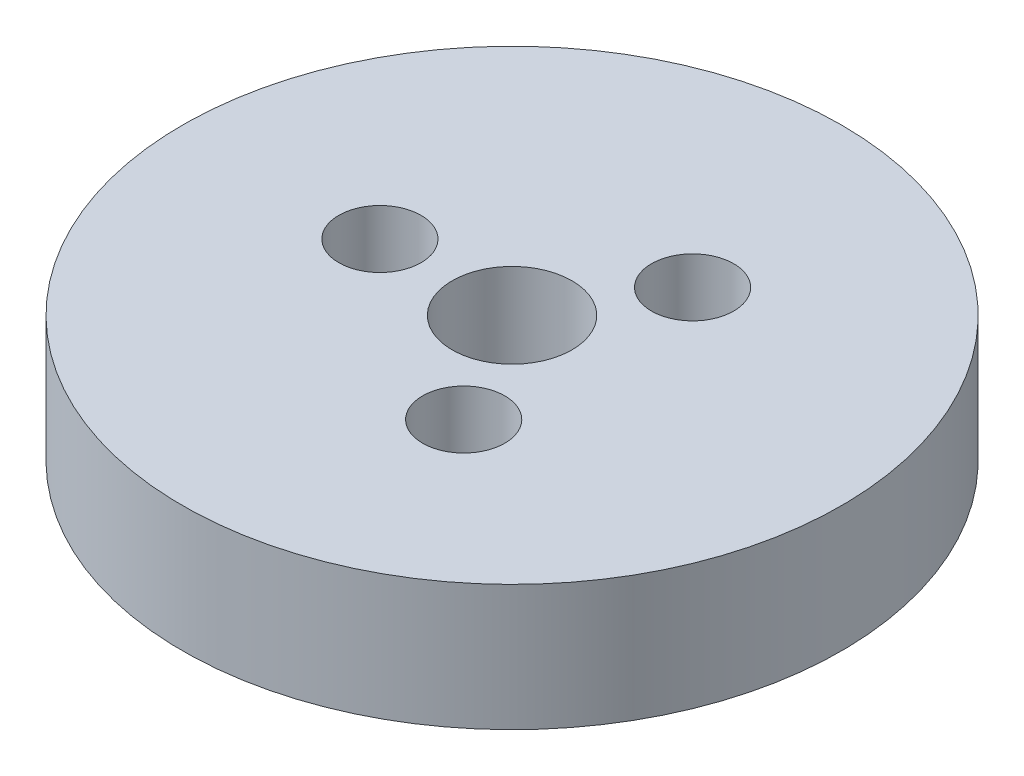
ISO-10303-21;
HEADER;
FILE_DESCRIPTION(('STEP AP214'),'2;1');
FILE_NAME('part.step','',(''),(''),'','','');
FILE_SCHEMA(('AUTOMOTIVE_DESIGN { 1 0 10303 214 1 1 1 1 }'));
ENDSEC;
DATA;
#1=APPLICATION_CONTEXT('core data for automotive mechanical design processes');
#2=APPLICATION_PROTOCOL_DEFINITION('international standard','automotive_design',2000,#1);
#3=PRODUCT_CONTEXT('',#1,'mechanical');
#4=PRODUCT('Part','Part','',(#3));
#5=PRODUCT_RELATED_PRODUCT_CATEGORY('part','',(#4));
#6=PRODUCT_DEFINITION_FORMATION('','',#4);
#7=PRODUCT_DEFINITION_CONTEXT('part definition',#1,'design');
#8=PRODUCT_DEFINITION('design','',#6,#7);
#9=PRODUCT_DEFINITION_SHAPE('','',#8);
#10=(LENGTH_UNIT() NAMED_UNIT(*) SI_UNIT(.MILLI.,.METRE.));
#11=(NAMED_UNIT(*) PLANE_ANGLE_UNIT() SI_UNIT($,.RADIAN.));
#12=(NAMED_UNIT(*) SI_UNIT($,.STERADIAN.) SOLID_ANGLE_UNIT());
#13=UNCERTAINTY_MEASURE_WITH_UNIT(LENGTH_MEASURE(1.E-05),#10,'distance_accuracy_value','');
#14=(GEOMETRIC_REPRESENTATION_CONTEXT(3) GLOBAL_UNCERTAINTY_ASSIGNED_CONTEXT((#13)) GLOBAL_UNIT_ASSIGNED_CONTEXT((#10,
#11,#12)) REPRESENTATION_CONTEXT('',''));
#15=CARTESIAN_POINT('',(0.,0.,0.));
#16=DIRECTION('',(0.,0.,1.));
#17=DIRECTION('',(1.,0.,0.));
#18=AXIS2_PLACEMENT_3D('',#15,#16,#17);
#19=CARTESIAN_POINT('',(0.,21.,0.));
#20=DIRECTION('',(0.,-1.,0.));
#21=DIRECTION('',(0.,0.,-1.));
#22=AXIS2_PLACEMENT_3D('',#19,#20,#21);
#23=CYLINDRICAL_SURFACE('',#22,55.);
#24=CARTESIAN_POINT('',(0.,21.,0.));
#25=DIRECTION('',(0.,1.,0.));
#26=DIRECTION('',(0.,0.,1.));
#27=AXIS2_PLACEMENT_3D('',#24,#25,#26);
#28=CIRCLE('',#27,55.);
#29=CARTESIAN_POINT('',(0.,21.,-55.));
#30=VERTEX_POINT('',#29);
#31=EDGE_CURVE('E10',#30,#30,#28,.T.);
#32=CARTESIAN_POINT('',(0.,0.,0.));
#33=DIRECTION('',(0.,1.,0.));
#34=DIRECTION('',(0.,0.,1.));
#35=AXIS2_PLACEMENT_3D('',#32,#33,#34);
#36=CIRCLE('',#35,55.);
#37=CARTESIAN_POINT('',(0.,0.,-55.));
#38=VERTEX_POINT('',#37);
#39=EDGE_CURVE('E37',#38,#38,#36,.T.);
#40=CARTESIAN_POINT('',(0.,21.,-55.));
#41=CARTESIAN_POINT('',(0.,20.78125,-55.));
#42=CARTESIAN_POINT('',(0.,20.5625,-55.));
#43=CARTESIAN_POINT('',(0.,20.125,-55.));
#44=CARTESIAN_POINT('',(0.,19.90625,-55.));
#45=CARTESIAN_POINT('',(0.,19.46875,-55.));
#46=CARTESIAN_POINT('',(0.,19.25,-55.));
#47=CARTESIAN_POINT('',(0.,18.8125,-55.));
#48=CARTESIAN_POINT('',(0.,18.59375,-55.));
#49=CARTESIAN_POINT('',(0.,18.15625,-55.));
#50=CARTESIAN_POINT('',(0.,17.9375,-55.));
#51=CARTESIAN_POINT('',(0.,17.5,-55.));
#52=CARTESIAN_POINT('',(0.,17.28125,-55.));
#53=CARTESIAN_POINT('',(0.,16.84375,-55.));
#54=CARTESIAN_POINT('',(0.,16.625,-55.));
#55=CARTESIAN_POINT('',(0.,16.1875,-55.));
#56=CARTESIAN_POINT('',(0.,15.96875,-55.));
#57=CARTESIAN_POINT('',(0.,15.53125,-55.));
#58=CARTESIAN_POINT('',(0.,15.3125,-55.));
#59=CARTESIAN_POINT('',(0.,14.875,-55.));
#60=CARTESIAN_POINT('',(0.,14.65625,-55.));
#61=CARTESIAN_POINT('',(0.,14.21875,-55.));
#62=CARTESIAN_POINT('',(0.,14.,-55.));
#63=CARTESIAN_POINT('',(0.,13.5625,-55.));
#64=CARTESIAN_POINT('',(0.,13.34375,-55.));
#65=CARTESIAN_POINT('',(0.,12.90625,-55.));
#66=CARTESIAN_POINT('',(0.,12.6875,-55.));
#67=CARTESIAN_POINT('',(0.,12.25,-55.));
#68=CARTESIAN_POINT('',(0.,12.03125,-55.));
#69=CARTESIAN_POINT('',(0.,11.59375,-55.));
#70=CARTESIAN_POINT('',(0.,11.375,-55.));
#71=CARTESIAN_POINT('',(0.,10.9375,-55.));
#72=CARTESIAN_POINT('',(0.,10.71875,-55.));
#73=CARTESIAN_POINT('',(0.,10.28125,-55.));
#74=CARTESIAN_POINT('',(0.,10.0625,-55.));
#75=CARTESIAN_POINT('',(0.,9.625,-55.));
#76=CARTESIAN_POINT('',(0.,9.40625,-55.));
#77=CARTESIAN_POINT('',(0.,8.96875,-55.));
#78=CARTESIAN_POINT('',(0.,8.75,-55.));
#79=CARTESIAN_POINT('',(0.,8.3125,-55.));
#80=CARTESIAN_POINT('',(0.,8.09375,-55.));
#81=CARTESIAN_POINT('',(0.,7.65625,-55.));
#82=CARTESIAN_POINT('',(0.,7.4375,-55.));
#83=CARTESIAN_POINT('',(0.,7.,-55.));
#84=CARTESIAN_POINT('',(0.,6.78125,-55.));
#85=CARTESIAN_POINT('',(0.,6.34375,-55.));
#86=CARTESIAN_POINT('',(0.,6.125,-55.));
#87=CARTESIAN_POINT('',(0.,5.6875,-55.));
#88=CARTESIAN_POINT('',(0.,5.46875,-55.));
#89=CARTESIAN_POINT('',(0.,5.03125,-55.));
#90=CARTESIAN_POINT('',(0.,4.8125,-55.));
#91=CARTESIAN_POINT('',(0.,4.375,-55.));
#92=CARTESIAN_POINT('',(0.,4.15625,-55.));
#93=CARTESIAN_POINT('',(0.,3.71875,-55.));
#94=CARTESIAN_POINT('',(0.,3.5,-55.));
#95=CARTESIAN_POINT('',(0.,3.0625,-55.));
#96=CARTESIAN_POINT('',(0.,2.84375,-55.));
#97=CARTESIAN_POINT('',(0.,2.40625,-55.));
#98=CARTESIAN_POINT('',(0.,2.1875,-55.));
#99=CARTESIAN_POINT('',(0.,1.75,-55.));
#100=CARTESIAN_POINT('',(0.,1.53125,-55.));
#101=CARTESIAN_POINT('',(0.,1.09375,-55.));
#102=CARTESIAN_POINT('',(0.,0.875000000000001,-55.));
#103=CARTESIAN_POINT('',(0.,0.4375,-55.));
#104=CARTESIAN_POINT('',(0.,0.21875,-55.));
#105=CARTESIAN_POINT('',(0.,0.,-55.));
#106=B_SPLINE_CURVE_WITH_KNOTS('',3,(#40,#41,#42,#43,#44,#45,#46,#47,#48,#49,#50,#51,#52,#53,
#54,#55,#56,#57,#58,#59,#60,#61,#62,#63,#64,#65,#66,#67,#68,#69,#70,#71,#72,#73,#74,#75,#76,#77,
#78,#79,#80,#81,#82,#83,#84,#85,#86,#87,#88,#89,#90,#91,#92,#93,#94,#95,#96,#97,#98,#99,#100,
#101,#102,#103,#104,#105),.UNSPECIFIED.,.F.,.F.,(4,2,2,2,2,2,2,2,2,2,2,2,2,2,2,2,2,2,2,2,2,2,2,
2,2,2,2,2,2,2,2,2,4),(0.,0.656250000000001,1.3125,1.96875,2.625,3.28125,3.9375,4.59375,5.25,
5.90625,6.5625,7.21875,7.875,8.53125,9.1875,9.84375,10.5,11.15625,11.8125,12.46875,13.125,
13.78125,14.4375,15.09375,15.75,16.40625,17.0625,17.71875,18.375,19.03125,19.6875,20.34375,21.),.UNSPECIFIED.);
#107=EDGE_CURVE('BSEAM40',#30,#38,#106,.T.);
#108=ORIENTED_EDGE('',*,*,#31,.F.);
#109=ORIENTED_EDGE('',*,*,#39,.T.);
#110=ORIENTED_EDGE('',*,*,#107,.T.);
#111=ORIENTED_EDGE('',*,*,#107,.F.);
#112=EDGE_LOOP('',(#108,#110,#109,#111));
#113=FACE_BOUND('',#112,.T.);
#114=ADVANCED_FACE('F40',(#113),#23,.T.);
#115=CARTESIAN_POINT('',(0.,21.,0.));
#116=DIRECTION('',(0.,1.,0.));
#117=DIRECTION('',(0.,0.,1.));
#118=AXIS2_PLACEMENT_3D('',#115,#116,#117);
#119=PLANE('',#118);
#120=CARTESIAN_POINT('',(11.0268460340764,21.,19.0990575782596));
#121=DIRECTION('',(0.,1.,0.));
#122=DIRECTION('',(0.866025403784436,0.,-0.500000000000004));
#123=AXIS2_PLACEMENT_3D('',#120,#121,#122);
#124=CIRCLE('',#123,6.85831979771959);
#125=CARTESIAN_POINT('',(16.9663252061793,21.,15.6698976793997));
#126=VERTEX_POINT('',#125);
#127=EDGE_CURVE('E70',#126,#126,#124,.T.);
#128=ORIENTED_EDGE('',*,*,#127,.F.);
#129=EDGE_LOOP('',(#128));
#130=FACE_BOUND('',#129,.T.);
#131=CARTESIAN_POINT('',(11.0268460340762,21.,-19.0990575782597));
#132=DIRECTION('',(0.,1.,0.));
#133=DIRECTION('',(-0.866025403784443,0.,-0.499999999999992));
#134=AXIS2_PLACEMENT_3D('',#131,#132,#133);
#135=CIRCLE('',#134,6.85831979771959);
#136=CARTESIAN_POINT('',(5.08736686197323,21.,-22.5282174771195));
#137=VERTEX_POINT('',#136);
#138=EDGE_CURVE('E61',#137,#137,#135,.T.);
#139=ORIENTED_EDGE('',*,*,#138,.F.);
#140=EDGE_LOOP('',(#139));
#141=FACE_BOUND('',#140,.T.);
#142=CARTESIAN_POINT('',(-22.0536920681527,21.,0.));
#143=DIRECTION('',(0.,1.,0.));
#144=DIRECTION('',(0.,0.,1.));
#145=AXIS2_PLACEMENT_3D('',#142,#143,#144);
#146=CIRCLE('',#145,6.85831979771959);
#147=CARTESIAN_POINT('',(-22.0536920681527,21.,6.85831979771959));
#148=VERTEX_POINT('',#147);
#149=EDGE_CURVE('E54',#148,#148,#146,.T.);
#150=ORIENTED_EDGE('',*,*,#149,.F.);
#151=EDGE_LOOP('',(#150));
#152=FACE_BOUND('',#151,.T.);
#153=CARTESIAN_POINT('',(0.,21.,0.));
#154=DIRECTION('',(0.,1.,0.));
#155=DIRECTION('',(0.,0.,1.));
#156=AXIS2_PLACEMENT_3D('',#153,#154,#155);
#157=CIRCLE('',#156,10.);
#158=CARTESIAN_POINT('',(0.,21.,-10.));
#159=VERTEX_POINT('',#158);
#160=EDGE_CURVE('E50',#159,#159,#157,.T.);
#161=ORIENTED_EDGE('',*,*,#160,.F.);
#162=EDGE_LOOP('',(#161));
#163=FACE_BOUND('',#162,.T.);
#164=ORIENTED_EDGE('',*,*,#31,.T.);
#165=EDGE_LOOP('',(#164));
#166=FACE_BOUND('',#165,.T.);
#167=ADVANCED_FACE('F85',(#130,#141,#152,#163,#166),#119,.T.);
#168=CARTESIAN_POINT('',(0.,0.,0.));
#169=DIRECTION('',(0.,1.,0.));
#170=DIRECTION('',(0.,0.,1.));
#171=AXIS2_PLACEMENT_3D('',#168,#169,#170);
#172=PLANE('',#171);
#173=CARTESIAN_POINT('',(0.,0.,0.));
#174=DIRECTION('',(0.,1.,0.));
#175=DIRECTION('',(0.,0.,1.));
#176=AXIS2_PLACEMENT_3D('',#173,#174,#175);
#177=CIRCLE('',#176,10.);
#178=CARTESIAN_POINT('',(0.,0.,-10.));
#179=VERTEX_POINT('',#178);
#180=EDGE_CURVE('E47',#179,#179,#177,.T.);
#181=ORIENTED_EDGE('',*,*,#180,.T.);
#182=EDGE_LOOP('',(#181));
#183=FACE_BOUND('',#182,.T.);
#184=ORIENTED_EDGE('',*,*,#39,.F.);
#185=EDGE_LOOP('',(#184));
#186=FACE_BOUND('',#185,.T.);
#187=ADVANCED_FACE('F84',(#183,#186),#172,.F.);
#188=CARTESIAN_POINT('',(0.,21.,0.));
#189=DIRECTION('',(0.,-1.,0.));
#190=DIRECTION('',(0.,0.,-1.));
#191=AXIS2_PLACEMENT_3D('',#188,#189,#190);
#192=CYLINDRICAL_SURFACE('',#191,10.);
#193=CARTESIAN_POINT('',(0.,21.,-10.));
#194=CARTESIAN_POINT('',(0.,20.78125,-10.));
#195=CARTESIAN_POINT('',(0.,20.5625,-10.));
#196=CARTESIAN_POINT('',(0.,20.125,-10.));
#197=CARTESIAN_POINT('',(0.,19.90625,-10.));
#198=CARTESIAN_POINT('',(0.,19.46875,-10.));
#199=CARTESIAN_POINT('',(0.,19.25,-10.));
#200=CARTESIAN_POINT('',(0.,18.8125,-10.));
#201=CARTESIAN_POINT('',(0.,18.59375,-10.));
#202=CARTESIAN_POINT('',(0.,18.15625,-10.));
#203=CARTESIAN_POINT('',(0.,17.9375,-10.));
#204=CARTESIAN_POINT('',(0.,17.5,-10.));
#205=CARTESIAN_POINT('',(0.,17.28125,-10.));
#206=CARTESIAN_POINT('',(0.,16.84375,-10.));
#207=CARTESIAN_POINT('',(0.,16.625,-10.));
#208=CARTESIAN_POINT('',(0.,16.1875,-10.));
#209=CARTESIAN_POINT('',(0.,15.96875,-10.));
#210=CARTESIAN_POINT('',(0.,15.53125,-10.));
#211=CARTESIAN_POINT('',(0.,15.3125,-10.));
#212=CARTESIAN_POINT('',(0.,14.875,-10.));
#213=CARTESIAN_POINT('',(0.,14.65625,-10.));
#214=CARTESIAN_POINT('',(0.,14.21875,-10.));
#215=CARTESIAN_POINT('',(0.,14.,-10.));
#216=CARTESIAN_POINT('',(0.,13.5625,-10.));
#217=CARTESIAN_POINT('',(0.,13.34375,-10.));
#218=CARTESIAN_POINT('',(0.,12.90625,-10.));
#219=CARTESIAN_POINT('',(0.,12.6875,-10.));
#220=CARTESIAN_POINT('',(0.,12.25,-10.));
#221=CARTESIAN_POINT('',(0.,12.03125,-10.));
#222=CARTESIAN_POINT('',(0.,11.59375,-10.));
#223=CARTESIAN_POINT('',(0.,11.375,-10.));
#224=CARTESIAN_POINT('',(0.,10.9375,-10.));
#225=CARTESIAN_POINT('',(0.,10.71875,-10.));
#226=CARTESIAN_POINT('',(0.,10.28125,-10.));
#227=CARTESIAN_POINT('',(0.,10.0625,-10.));
#228=CARTESIAN_POINT('',(0.,9.625,-10.));
#229=CARTESIAN_POINT('',(0.,9.40625,-10.));
#230=CARTESIAN_POINT('',(0.,8.96875,-10.));
#231=CARTESIAN_POINT('',(0.,8.75,-10.));
#232=CARTESIAN_POINT('',(0.,8.3125,-10.));
#233=CARTESIAN_POINT('',(0.,8.09375,-10.));
#234=CARTESIAN_POINT('',(0.,7.65625,-10.));
#235=CARTESIAN_POINT('',(0.,7.4375,-10.));
#236=CARTESIAN_POINT('',(0.,7.,-10.));
#237=CARTESIAN_POINT('',(0.,6.78125,-10.));
#238=CARTESIAN_POINT('',(0.,6.34375,-10.));
#239=CARTESIAN_POINT('',(0.,6.125,-10.));
#240=CARTESIAN_POINT('',(0.,5.6875,-10.));
#241=CARTESIAN_POINT('',(0.,5.46875,-10.));
#242=CARTESIAN_POINT('',(0.,5.03125,-10.));
#243=CARTESIAN_POINT('',(0.,4.8125,-10.));
#244=CARTESIAN_POINT('',(0.,4.375,-10.));
#245=CARTESIAN_POINT('',(0.,4.15625,-10.));
#246=CARTESIAN_POINT('',(0.,3.71875,-10.));
#247=CARTESIAN_POINT('',(0.,3.5,-10.));
#248=CARTESIAN_POINT('',(0.,3.0625,-10.));
#249=CARTESIAN_POINT('',(0.,2.84375,-10.));
#250=CARTESIAN_POINT('',(0.,2.40625,-10.));
#251=CARTESIAN_POINT('',(0.,2.1875,-10.));
#252=CARTESIAN_POINT('',(0.,1.75,-10.));
#253=CARTESIAN_POINT('',(0.,1.53125,-10.));
#254=CARTESIAN_POINT('',(0.,1.09375,-10.));
#255=CARTESIAN_POINT('',(0.,0.875000000000001,-10.));
#256=CARTESIAN_POINT('',(0.,0.4375,-10.));
#257=CARTESIAN_POINT('',(0.,0.21875,-10.));
#258=CARTESIAN_POINT('',(0.,0.,-10.));
#259=B_SPLINE_CURVE_WITH_KNOTS('',3,(#193,#194,#195,#196,#197,#198,#199,#200,#201,#202,#203,
#204,#205,#206,#207,#208,#209,#210,#211,#212,#213,#214,#215,#216,#217,#218,#219,#220,#221,#222,
#223,#224,#225,#226,#227,#228,#229,#230,#231,#232,#233,#234,#235,#236,#237,#238,#239,#240,#241,
#242,#243,#244,#245,#246,#247,#248,#249,#250,#251,#252,#253,#254,#255,#256,#257,#258),
.UNSPECIFIED.,.F.,.F.,(4,2,2,2,2,2,2,2,2,2,2,2,2,2,2,2,2,2,2,2,2,2,2,2,2,2,2,2,2,2,2,2,4),(0.,
0.656249999999997,1.3125,1.96875,2.625,3.28125,3.9375,4.59375,5.25,5.90625,6.5625,7.21875,7.875,
8.53125,9.1875,9.84375,10.5,11.15625,11.8125,12.46875,13.125,13.78125,14.4375,15.09375,15.75,
16.40625,17.0625,17.71875,18.375,19.03125,19.6875,20.34375,21.),.UNSPECIFIED.);
#260=EDGE_CURVE('BSEAM91',#159,#179,#259,.T.);
#261=ORIENTED_EDGE('',*,*,#160,.T.);
#262=ORIENTED_EDGE('',*,*,#180,.F.);
#263=ORIENTED_EDGE('',*,*,#260,.T.);
#264=ORIENTED_EDGE('',*,*,#260,.F.);
#265=EDGE_LOOP('',(#261,#263,#262,#264));
#266=FACE_BOUND('',#265,.T.);
#267=ADVANCED_FACE('F91',(#266),#192,.F.);
#268=CARTESIAN_POINT('',(-22.0536920681527,5.38941500624375,0.));
#269=DIRECTION('',(0.,1.,0.));
#270=DIRECTION('',(0.,0.,1.));
#271=AXIS2_PLACEMENT_3D('',#268,#269,#270);
#272=CYLINDRICAL_SURFACE('',#271,6.85831979771959);
#273=CARTESIAN_POINT('',(-22.0536920681527,5.38941500624375,0.));
#274=DIRECTION('',(0.,1.,0.));
#275=DIRECTION('',(0.,0.,1.));
#276=AXIS2_PLACEMENT_3D('',#273,#274,#275);
#277=CIRCLE('',#276,6.85831979771959);
#278=CARTESIAN_POINT('',(-22.0536920681527,5.38941500624375,6.85831979771959));
#279=VERTEX_POINT('',#278);
#280=EDGE_CURVE('E55',#279,#279,#277,.T.);
#281=ORIENTED_EDGE('',*,*,#280,.F.);
#282=EDGE_LOOP('',(#281));
#283=FACE_BOUND('',#282,.T.);
#284=ORIENTED_EDGE('',*,*,#149,.T.);
#285=EDGE_LOOP('',(#284));
#286=FACE_BOUND('',#285,.T.);
#287=ADVANCED_FACE('F96',(#283,#286),#272,.F.);
#288=CARTESIAN_POINT('',(-22.0536920681527,5.38941500624375,0.));
#289=DIRECTION('',(0.,1.,0.));
#290=DIRECTION('',(0.,0.,1.));
#291=AXIS2_PLACEMENT_3D('',#288,#289,#290);
#292=PLANE('',#291);
#293=ORIENTED_EDGE('',*,*,#280,.T.);
#294=EDGE_LOOP('',(#293));
#295=FACE_BOUND('',#294,.T.);
#296=ADVANCED_FACE('F127',(#295),#292,.T.);
#297=CARTESIAN_POINT('',(11.0268460340762,5.38941500624375,-19.0990575782597));
#298=DIRECTION('',(0.,1.,0.));
#299=DIRECTION('',(0.,0.,1.));
#300=AXIS2_PLACEMENT_3D('',#297,#298,#299);
#301=CYLINDRICAL_SURFACE('',#300,6.85831979771959);
#302=CARTESIAN_POINT('',(11.0268460340762,5.38941500624375,-19.0990575782597));
#303=DIRECTION('',(0.,1.,0.));
#304=DIRECTION('',(-0.866025403784443,0.,-0.499999999999992));
#305=AXIS2_PLACEMENT_3D('',#302,#303,#304);
#306=CIRCLE('',#305,6.85831979771959);
#307=CARTESIAN_POINT('',(5.08736686197323,5.38941500624375,-22.5282174771195));
#308=VERTEX_POINT('',#307);
#309=EDGE_CURVE('E63',#308,#308,#306,.T.);
#310=ORIENTED_EDGE('',*,*,#309,.F.);
#311=EDGE_LOOP('',(#310));
#312=FACE_BOUND('',#311,.T.);
#313=ORIENTED_EDGE('',*,*,#138,.T.);
#314=EDGE_LOOP('',(#313));
#315=FACE_BOUND('',#314,.T.);
#316=ADVANCED_FACE('F133',(#312,#315),#301,.F.);
#317=CARTESIAN_POINT('',(11.0268460340762,5.38941500624375,-19.0990575782597));
#318=DIRECTION('',(0.,1.,0.));
#319=DIRECTION('',(-0.866025403784443,0.,-0.499999999999992));
#320=AXIS2_PLACEMENT_3D('',#317,#318,#319);
#321=PLANE('',#320);
#322=ORIENTED_EDGE('',*,*,#309,.T.);
#323=EDGE_LOOP('',(#322));
#324=FACE_BOUND('',#323,.T.);
#325=ADVANCED_FACE('F77',(#324),#321,.T.);
#326=CARTESIAN_POINT('',(11.0268460340764,5.38941500624375,19.0990575782596));
#327=DIRECTION('',(0.,1.,0.));
#328=DIRECTION('',(0.,0.,1.));
#329=AXIS2_PLACEMENT_3D('',#326,#327,#328);
#330=CYLINDRICAL_SURFACE('',#329,6.85831979771959);
#331=CARTESIAN_POINT('',(11.0268460340764,5.38941500624375,19.0990575782596));
#332=DIRECTION('',(0.,1.,0.));
#333=DIRECTION('',(0.866025403784436,0.,-0.500000000000004));
#334=AXIS2_PLACEMENT_3D('',#331,#332,#333);
#335=CIRCLE('',#334,6.85831979771959);
#336=CARTESIAN_POINT('',(16.9663252061793,5.38941500624375,15.6698976793997));
#337=VERTEX_POINT('',#336);
#338=EDGE_CURVE('E59',#337,#337,#335,.T.);
#339=ORIENTED_EDGE('',*,*,#338,.F.);
#340=EDGE_LOOP('',(#339));
#341=FACE_BOUND('',#340,.T.);
#342=ORIENTED_EDGE('',*,*,#127,.T.);
#343=EDGE_LOOP('',(#342));
#344=FACE_BOUND('',#343,.T.);
#345=ADVANCED_FACE('F73',(#341,#344),#330,.F.);
#346=CARTESIAN_POINT('',(11.0268460340764,5.38941500624375,19.0990575782596));
#347=DIRECTION('',(0.,1.,0.));
#348=DIRECTION('',(0.866025403784436,0.,-0.500000000000004));
#349=AXIS2_PLACEMENT_3D('',#346,#347,#348);
#350=PLANE('',#349);
#351=ORIENTED_EDGE('',*,*,#338,.T.);
#352=EDGE_LOOP('',(#351));
#353=FACE_BOUND('',#352,.T.);
#354=ADVANCED_FACE('F71',(#353),#350,.T.);
#355=CLOSED_SHELL('',(#114,#167,#187,#267,#287,#296,#316,#325,#345,#354));
#356=MANIFOLD_SOLID_BREP('B2',#355);
#357=ADVANCED_BREP_SHAPE_REPRESENTATION('',(#18,#356),#14);
#358=SHAPE_DEFINITION_REPRESENTATION(#9,#357);
ENDSEC;
END-ISO-10303-21;
